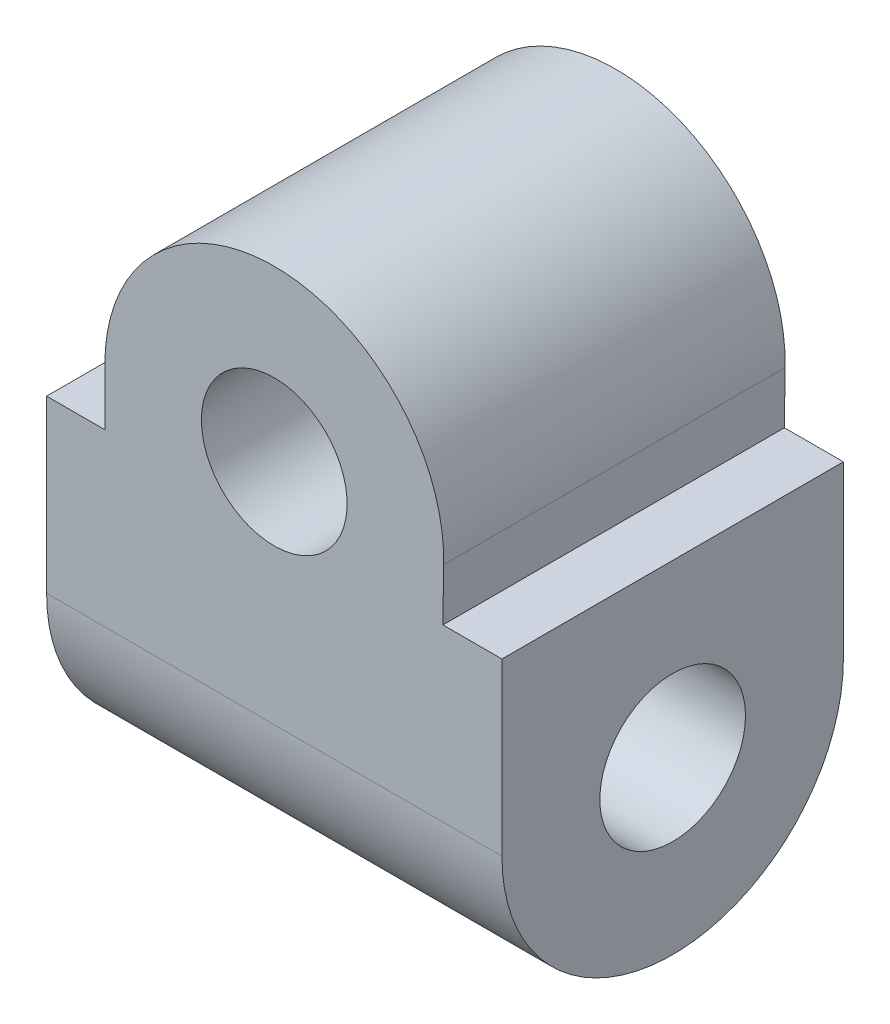
ISO-10303-21;
HEADER;
FILE_DESCRIPTION(('STEP AP214'),'2;1');
FILE_NAME('part.step','',(''),(''),'','','');
FILE_SCHEMA(('AUTOMOTIVE_DESIGN { 1 0 10303 214 1 1 1 1 }'));
ENDSEC;
DATA;
#1=APPLICATION_CONTEXT('core data for automotive mechanical design processes');
#2=APPLICATION_PROTOCOL_DEFINITION('international standard','automotive_design',2000,#1);
#3=PRODUCT_CONTEXT('',#1,'mechanical');
#4=PRODUCT('Part','Part','',(#3));
#5=PRODUCT_RELATED_PRODUCT_CATEGORY('part','',(#4));
#6=PRODUCT_DEFINITION_FORMATION('','',#4);
#7=PRODUCT_DEFINITION_CONTEXT('part definition',#1,'design');
#8=PRODUCT_DEFINITION('design','',#6,#7);
#9=PRODUCT_DEFINITION_SHAPE('','',#8);
#10=(LENGTH_UNIT() NAMED_UNIT(*) SI_UNIT(.MILLI.,.METRE.));
#11=(NAMED_UNIT(*) PLANE_ANGLE_UNIT() SI_UNIT($,.RADIAN.));
#12=(NAMED_UNIT(*) SI_UNIT($,.STERADIAN.) SOLID_ANGLE_UNIT());
#13=UNCERTAINTY_MEASURE_WITH_UNIT(LENGTH_MEASURE(1.E-05),#10,'distance_accuracy_value','');
#14=(GEOMETRIC_REPRESENTATION_CONTEXT(3) GLOBAL_UNCERTAINTY_ASSIGNED_CONTEXT((#13)) GLOBAL_UNIT_ASSIGNED_CONTEXT((#10,
#11,#12)) REPRESENTATION_CONTEXT('',''));
#15=CARTESIAN_POINT('',(0.,0.,0.));
#16=DIRECTION('',(0.,0.,1.));
#17=DIRECTION('',(1.,0.,0.));
#18=AXIS2_PLACEMENT_3D('',#15,#16,#17);
#19=CARTESIAN_POINT('',(40.,0.,0.));
#20=DIRECTION('',(1.,0.,0.));
#21=DIRECTION('',(0.,0.,-1.));
#22=AXIS2_PLACEMENT_3D('',#19,#20,#21);
#23=PLANE('',#22);
#24=DIRECTION('',(0.,0.,-1.));
#25=VECTOR('',#24,1.);
#26=CARTESIAN_POINT('',(40.,15.,0.));
#27=LINE('',#26,#25);
#28=CARTESIAN_POINT('',(40.,15.,15.));
#29=VERTEX_POINT('',#28);
#30=CARTESIAN_POINT('',(40.,15.,-15.));
#31=VERTEX_POINT('',#30);
#32=EDGE_CURVE('E158',#29,#31,#27,.T.);
#33=ORIENTED_EDGE('',*,*,#32,.F.);
#34=DIRECTION('',(0.,-1.,0.));
#35=VECTOR('',#34,1.);
#36=CARTESIAN_POINT('',(40.,0.,15.));
#37=LINE('',#36,#35);
#38=CARTESIAN_POINT('',(40.,0.,15.));
#39=VERTEX_POINT('',#38);
#40=EDGE_CURVE('E61',#29,#39,#37,.T.);
#41=ORIENTED_EDGE('',*,*,#40,.T.);
#42=CARTESIAN_POINT('',(40.,0.,0.));
#43=DIRECTION('',(1.,0.,0.));
#44=DIRECTION('',(0.,0.,-1.));
#45=AXIS2_PLACEMENT_3D('',#42,#43,#44);
#46=CIRCLE('',#45,15.);
#47=CARTESIAN_POINT('',(40.,0.,-15.));
#48=VERTEX_POINT('',#47);
#49=EDGE_CURVE('E87',#39,#48,#46,.T.);
#50=ORIENTED_EDGE('',*,*,#49,.T.);
#51=DIRECTION('',(0.,1.,0.));
#52=VECTOR('',#51,1.);
#53=CARTESIAN_POINT('',(40.,0.,-15.));
#54=LINE('',#53,#52);
#55=EDGE_CURVE('E162',#48,#31,#54,.T.);
#56=ORIENTED_EDGE('',*,*,#55,.T.);
#57=EDGE_LOOP('',(#33,#41,#50,#56));
#58=FACE_BOUND('',#57,.T.);
#59=CARTESIAN_POINT('',(40.,0.,0.));
#60=DIRECTION('',(1.,0.,0.));
#61=DIRECTION('',(0.,0.,-1.));
#62=AXIS2_PLACEMENT_3D('',#59,#60,#61);
#63=CIRCLE('',#62,6.4);
#64=CARTESIAN_POINT('',(40.,0.,-6.4));
#65=VERTEX_POINT('',#64);
#66=EDGE_CURVE('E100',#65,#65,#63,.T.);
#67=ORIENTED_EDGE('',*,*,#66,.F.);
#68=EDGE_LOOP('',(#67));
#69=FACE_BOUND('',#68,.T.);
#70=ADVANCED_FACE('F37',(#58,#69),#23,.T.);
#71=CARTESIAN_POINT('',(0.,0.,0.));
#72=DIRECTION('',(1.,0.,0.));
#73=DIRECTION('',(0.,0.,-1.));
#74=AXIS2_PLACEMENT_3D('',#71,#72,#73);
#75=PLANE('',#74);
#76=DIRECTION('',(0.,-1.,0.));
#77=VECTOR('',#76,1.);
#78=CARTESIAN_POINT('',(0.,0.,15.));
#79=LINE('',#78,#77);
#80=CARTESIAN_POINT('',(0.,15.,15.));
#81=VERTEX_POINT('',#80);
#82=CARTESIAN_POINT('',(0.,0.,15.));
#83=VERTEX_POINT('',#82);
#84=EDGE_CURVE('E75',#81,#83,#79,.T.);
#85=ORIENTED_EDGE('',*,*,#84,.F.);
#86=DIRECTION('',(0.,0.,-1.));
#87=VECTOR('',#86,1.);
#88=CARTESIAN_POINT('',(0.,15.,0.));
#89=LINE('',#88,#87);
#90=CARTESIAN_POINT('',(0.,15.,-15.));
#91=VERTEX_POINT('',#90);
#92=EDGE_CURVE('E114',#81,#91,#89,.T.);
#93=ORIENTED_EDGE('',*,*,#92,.T.);
#94=DIRECTION('',(0.,1.,0.));
#95=VECTOR('',#94,1.);
#96=CARTESIAN_POINT('',(0.,0.,-15.));
#97=LINE('',#96,#95);
#98=CARTESIAN_POINT('',(0.,0.,-15.));
#99=VERTEX_POINT('',#98);
#100=EDGE_CURVE('E88',#99,#91,#97,.T.);
#101=ORIENTED_EDGE('',*,*,#100,.F.);
#102=CARTESIAN_POINT('',(0.,0.,0.));
#103=DIRECTION('',(1.,0.,0.));
#104=DIRECTION('',(0.,0.,-1.));
#105=AXIS2_PLACEMENT_3D('',#102,#103,#104);
#106=CIRCLE('',#105,15.);
#107=EDGE_CURVE('E93',#83,#99,#106,.T.);
#108=ORIENTED_EDGE('',*,*,#107,.F.);
#109=EDGE_LOOP('',(#85,#93,#101,#108));
#110=FACE_BOUND('',#109,.T.);
#111=CARTESIAN_POINT('',(0.,0.,0.));
#112=DIRECTION('',(1.,0.,0.));
#113=DIRECTION('',(0.,0.,-1.));
#114=AXIS2_PLACEMENT_3D('',#111,#112,#113);
#115=CIRCLE('',#114,6.4);
#116=CARTESIAN_POINT('',(0.,0.,-6.4));
#117=VERTEX_POINT('',#116);
#118=EDGE_CURVE('E104',#117,#117,#115,.T.);
#119=ORIENTED_EDGE('',*,*,#118,.T.);
#120=EDGE_LOOP('',(#119));
#121=FACE_BOUND('',#120,.T.);
#122=ADVANCED_FACE('F96',(#110,#121),#75,.F.);
#123=CARTESIAN_POINT('',(40.,0.,0.));
#124=DIRECTION('',(-1.,0.,0.));
#125=DIRECTION('',(0.,0.,1.));
#126=AXIS2_PLACEMENT_3D('',#123,#124,#125);
#127=CYLINDRICAL_SURFACE('',#126,15.);
#128=ORIENTED_EDGE('',*,*,#107,.T.);
#129=DIRECTION('',(-1.,0.,0.));
#130=VECTOR('',#129,1.);
#131=CARTESIAN_POINT('',(40.,0.,-15.));
#132=LINE('',#131,#130);
#133=EDGE_CURVE('E94',#48,#99,#132,.T.);
#134=ORIENTED_EDGE('',*,*,#133,.F.);
#135=ORIENTED_EDGE('',*,*,#49,.F.);
#136=DIRECTION('',(-1.,0.,0.));
#137=VECTOR('',#136,1.);
#138=CARTESIAN_POINT('',(40.,0.,15.));
#139=LINE('',#138,#137);
#140=EDGE_CURVE('E79',#39,#83,#139,.T.);
#141=ORIENTED_EDGE('',*,*,#140,.T.);
#142=EDGE_LOOP('',(#128,#134,#135,#141));
#143=FACE_BOUND('',#142,.T.);
#144=ADVANCED_FACE('F39',(#143),#127,.T.);
#145=CARTESIAN_POINT('',(40.,0.,-15.));
#146=DIRECTION('',(0.,0.,1.));
#147=DIRECTION('',(1.,0.,0.));
#148=AXIS2_PLACEMENT_3D('',#145,#146,#147);
#149=PLANE('',#148);
#150=CARTESIAN_POINT('',(20.,20.,-15.));
#151=DIRECTION('',(0.,0.,-1.));
#152=DIRECTION('',(-1.,0.,0.));
#153=AXIS2_PLACEMENT_3D('',#150,#151,#152);
#154=CIRCLE('',#153,6.4);
#155=CARTESIAN_POINT('',(13.6,20.,-15.));
#156=VERTEX_POINT('',#155);
#157=EDGE_CURVE('E115',#156,#156,#154,.T.);
#158=ORIENTED_EDGE('',*,*,#157,.F.);
#159=EDGE_LOOP('',(#158));
#160=FACE_BOUND('',#159,.T.);
#161=DIRECTION('',(0.0130738964265423,0.999914532963807,0.));
#162=VECTOR('',#161,1.);
#163=CARTESIAN_POINT('',(34.8169645801396,15.,-15.));
#164=LINE('',#163,#162);
#165=CARTESIAN_POINT('',(34.8169645801396,15.,-15.));
#166=VERTEX_POINT('',#165);
#167=CARTESIAN_POINT('',(34.8772520692594,19.6108929243419,-15.));
#168=VERTEX_POINT('',#167);
#169=EDGE_CURVE('E154',#166,#168,#164,.T.);
#170=ORIENTED_EDGE('',*,*,#169,.F.);
#171=DIRECTION('',(-1.,0.,0.));
#172=VECTOR('',#171,1.);
#173=CARTESIAN_POINT('',(46.0074782063566,15.,-15.));
#174=LINE('',#173,#172);
#175=EDGE_CURVE('E144',#31,#166,#174,.T.);
#176=ORIENTED_EDGE('',*,*,#175,.F.);
#177=ORIENTED_EDGE('',*,*,#55,.F.);
#178=ORIENTED_EDGE('',*,*,#133,.T.);
#179=ORIENTED_EDGE('',*,*,#100,.T.);
#180=DIRECTION('',(-1.,0.,0.));
#181=VECTOR('',#180,1.);
#182=CARTESIAN_POINT('',(5.11766035031421,15.,-15.));
#183=LINE('',#182,#181);
#184=CARTESIAN_POINT('',(5.11766035031421,15.,-15.));
#185=VERTEX_POINT('',#184);
#186=EDGE_CURVE('E169',#185,#91,#183,.T.);
#187=ORIENTED_EDGE('',*,*,#186,.F.);
#188=DIRECTION('',(0.,-1.,0.));
#189=VECTOR('',#188,1.);
#190=CARTESIAN_POINT('',(5.11766035031421,20.,-15.));
#191=LINE('',#190,#189);
#192=CARTESIAN_POINT('',(5.11766035031421,20.,-15.));
#193=VERTEX_POINT('',#192);
#194=EDGE_CURVE('E172',#193,#185,#191,.T.);
#195=ORIENTED_EDGE('',*,*,#194,.F.);
#196=CARTESIAN_POINT('',(20.,20.,-15.));
#197=DIRECTION('',(0.,0.,1.));
#198=DIRECTION('',(-1.,0.,0.));
#199=AXIS2_PLACEMENT_3D('',#196,#197,#198);
#200=CIRCLE('',#199,14.8823396496858);
#201=EDGE_CURVE('E176',#168,#193,#200,.T.);
#202=ORIENTED_EDGE('',*,*,#201,.F.);
#203=EDGE_LOOP('',(#170,#176,#177,#178,#179,#187,#195,#202));
#204=FACE_BOUND('',#203,.T.);
#205=ADVANCED_FACE('F167',(#160,#204),#149,.F.);
#206=CARTESIAN_POINT('',(40.,0.,15.));
#207=DIRECTION('',(0.,0.,-1.));
#208=DIRECTION('',(-1.,0.,0.));
#209=AXIS2_PLACEMENT_3D('',#206,#207,#208);
#210=PLANE('',#209);
#211=ORIENTED_EDGE('',*,*,#40,.F.);
#212=DIRECTION('',(-1.,0.,0.));
#213=VECTOR('',#212,1.);
#214=CARTESIAN_POINT('',(40.,15.,15.));
#215=LINE('',#214,#213);
#216=CARTESIAN_POINT('',(34.8169645801396,15.,15.));
#217=VERTEX_POINT('',#216);
#218=EDGE_CURVE('E11',#29,#217,#215,.T.);
#219=ORIENTED_EDGE('',*,*,#218,.T.);
#220=DIRECTION('',(0.0130738964265423,0.999914532963807,0.));
#221=VECTOR('',#220,1.);
#222=CARTESIAN_POINT('',(34.6217588140408,0.0703205783136071,15.));
#223=LINE('',#222,#221);
#224=CARTESIAN_POINT('',(34.8772520692594,19.6108929243419,15.));
#225=VERTEX_POINT('',#224);
#226=EDGE_CURVE('E45',#217,#225,#223,.T.);
#227=ORIENTED_EDGE('',*,*,#226,.T.);
#228=CARTESIAN_POINT('',(20.,20.,15.));
#229=DIRECTION('',(0.,0.,-1.));
#230=DIRECTION('',(-1.,0.,0.));
#231=AXIS2_PLACEMENT_3D('',#228,#229,#230);
#232=CIRCLE('',#231,14.8823396496858);
#233=CARTESIAN_POINT('',(5.11766035031421,20.,15.));
#234=VERTEX_POINT('',#233);
#235=EDGE_CURVE('E118',#225,#234,#232,.F.);
#236=ORIENTED_EDGE('',*,*,#235,.T.);
#237=DIRECTION('',(0.,-1.,0.));
#238=VECTOR('',#237,1.);
#239=CARTESIAN_POINT('',(5.1176603503142,0.,15.));
#240=LINE('',#239,#238);
#241=CARTESIAN_POINT('',(5.11766035031421,15.,15.));
#242=VERTEX_POINT('',#241);
#243=EDGE_CURVE('E110',#234,#242,#240,.T.);
#244=ORIENTED_EDGE('',*,*,#243,.T.);
#245=DIRECTION('',(-1.,0.,0.));
#246=VECTOR('',#245,1.);
#247=CARTESIAN_POINT('',(40.,15.,15.));
#248=LINE('',#247,#246);
#249=EDGE_CURVE('E83',#242,#81,#248,.T.);
#250=ORIENTED_EDGE('',*,*,#249,.T.);
#251=ORIENTED_EDGE('',*,*,#84,.T.);
#252=ORIENTED_EDGE('',*,*,#140,.F.);
#253=EDGE_LOOP('',(#211,#219,#227,#236,#244,#250,#251,#252));
#254=FACE_BOUND('',#253,.T.);
#255=CARTESIAN_POINT('',(20.,20.,15.));
#256=DIRECTION('',(0.,0.,-1.));
#257=DIRECTION('',(-1.,0.,0.));
#258=AXIS2_PLACEMENT_3D('',#255,#256,#257);
#259=CIRCLE('',#258,6.4);
#260=CARTESIAN_POINT('',(13.6,20.,15.));
#261=VERTEX_POINT('',#260);
#262=EDGE_CURVE('E111',#261,#261,#259,.T.);
#263=ORIENTED_EDGE('',*,*,#262,.T.);
#264=EDGE_LOOP('',(#263));
#265=FACE_BOUND('',#264,.T.);
#266=ADVANCED_FACE('F77',(#254,#265),#210,.F.);
#267=CARTESIAN_POINT('',(40.,0.,0.));
#268=DIRECTION('',(-1.,0.,0.));
#269=DIRECTION('',(0.,0.,1.));
#270=AXIS2_PLACEMENT_3D('',#267,#268,#269);
#271=CYLINDRICAL_SURFACE('',#270,6.4);
#272=ORIENTED_EDGE('',*,*,#66,.T.);
#273=EDGE_LOOP('',(#272));
#274=FACE_BOUND('',#273,.T.);
#275=ORIENTED_EDGE('',*,*,#118,.F.);
#276=EDGE_LOOP('',(#275));
#277=FACE_BOUND('',#276,.T.);
#278=ADVANCED_FACE('F215',(#274,#277),#271,.F.);
#279=CARTESIAN_POINT('',(20.,20.,28.));
#280=DIRECTION('',(0.,0.,-1.));
#281=DIRECTION('',(-1.,0.,0.));
#282=AXIS2_PLACEMENT_3D('',#279,#280,#281);
#283=CYLINDRICAL_SURFACE('',#282,6.4);
#284=ORIENTED_EDGE('',*,*,#157,.T.);
#285=EDGE_LOOP('',(#284));
#286=FACE_BOUND('',#285,.T.);
#287=ORIENTED_EDGE('',*,*,#262,.F.);
#288=EDGE_LOOP('',(#287));
#289=FACE_BOUND('',#288,.T.);
#290=ADVANCED_FACE('F226',(#286,#289),#283,.F.);
#291=CARTESIAN_POINT('',(20.,20.,28.));
#292=DIRECTION('',(0.,0.,-1.));
#293=DIRECTION('',(-1.,0.,0.));
#294=AXIS2_PLACEMENT_3D('',#291,#292,#293);
#295=CYLINDRICAL_SURFACE('',#294,14.8823396496858);
#296=DIRECTION('',(0.,0.,-1.));
#297=VECTOR('',#296,1.);
#298=CARTESIAN_POINT('',(34.8772520692594,19.6108929243419,28.));
#299=LINE('',#298,#297);
#300=EDGE_CURVE('E137',#225,#168,#299,.T.);
#301=ORIENTED_EDGE('',*,*,#300,.T.);
#302=ORIENTED_EDGE('',*,*,#201,.T.);
#303=DIRECTION('',(0.,0.,-1.));
#304=VECTOR('',#303,1.);
#305=CARTESIAN_POINT('',(5.11766035031421,20.,28.));
#306=LINE('',#305,#304);
#307=EDGE_CURVE('E148',#234,#193,#306,.T.);
#308=ORIENTED_EDGE('',*,*,#307,.F.);
#309=ORIENTED_EDGE('',*,*,#235,.F.);
#310=EDGE_LOOP('',(#301,#302,#308,#309));
#311=FACE_BOUND('',#310,.T.);
#312=ADVANCED_FACE('F182',(#311),#295,.T.);
#313=CARTESIAN_POINT('',(34.8169645801396,15.,28.));
#314=DIRECTION('',(-0.999914532963807,0.0130738964265423,0.));
#315=DIRECTION('',(-0.0130738964265423,-0.999914532963807,0.));
#316=AXIS2_PLACEMENT_3D('',#313,#314,#315);
#317=PLANE('',#316);
#318=DIRECTION('',(0.,0.,-1.));
#319=VECTOR('',#318,1.);
#320=CARTESIAN_POINT('',(34.8169645801396,15.,28.));
#321=LINE('',#320,#319);
#322=EDGE_CURVE('E134',#217,#166,#321,.T.);
#323=ORIENTED_EDGE('',*,*,#322,.T.);
#324=ORIENTED_EDGE('',*,*,#169,.T.);
#325=ORIENTED_EDGE('',*,*,#300,.F.);
#326=ORIENTED_EDGE('',*,*,#226,.F.);
#327=EDGE_LOOP('',(#323,#324,#325,#326));
#328=FACE_BOUND('',#327,.T.);
#329=ADVANCED_FACE('F131',(#328),#317,.F.);
#330=CARTESIAN_POINT('',(5.11766035031421,15.,28.));
#331=DIRECTION('',(0.,-1.,0.));
#332=DIRECTION('',(1.,0.,0.));
#333=AXIS2_PLACEMENT_3D('',#330,#331,#332);
#334=PLANE('',#333);
#335=ORIENTED_EDGE('',*,*,#249,.F.);
#336=DIRECTION('',(0.,0.,-1.));
#337=VECTOR('',#336,1.);
#338=CARTESIAN_POINT('',(5.11766035031421,15.,28.));
#339=LINE('',#338,#337);
#340=EDGE_CURVE('E52',#242,#185,#339,.T.);
#341=ORIENTED_EDGE('',*,*,#340,.T.);
#342=ORIENTED_EDGE('',*,*,#186,.T.);
#343=ORIENTED_EDGE('',*,*,#92,.F.);
#344=EDGE_LOOP('',(#335,#341,#342,#343));
#345=FACE_BOUND('',#344,.T.);
#346=ADVANCED_FACE('F198',(#345),#334,.F.);
#347=CARTESIAN_POINT('',(5.11766035031421,20.,28.));
#348=DIRECTION('',(1.,0.,0.));
#349=DIRECTION('',(0.,1.,0.));
#350=AXIS2_PLACEMENT_3D('',#347,#348,#349);
#351=PLANE('',#350);
#352=ORIENTED_EDGE('',*,*,#307,.T.);
#353=ORIENTED_EDGE('',*,*,#194,.T.);
#354=ORIENTED_EDGE('',*,*,#340,.F.);
#355=ORIENTED_EDGE('',*,*,#243,.F.);
#356=EDGE_LOOP('',(#352,#353,#354,#355));
#357=FACE_BOUND('',#356,.T.);
#358=ADVANCED_FACE('F187',(#357),#351,.F.);
#359=CARTESIAN_POINT('',(46.0074782063566,15.,28.));
#360=DIRECTION('',(0.,-1.,0.));
#361=DIRECTION('',(0.,0.,-1.));
#362=AXIS2_PLACEMENT_3D('',#359,#360,#361);
#363=PLANE('',#362);
#364=ORIENTED_EDGE('',*,*,#32,.T.);
#365=ORIENTED_EDGE('',*,*,#175,.T.);
#366=ORIENTED_EDGE('',*,*,#322,.F.);
#367=ORIENTED_EDGE('',*,*,#218,.F.);
#368=EDGE_LOOP('',(#364,#365,#366,#367));
#369=FACE_BOUND('',#368,.T.);
#370=ADVANCED_FACE('F142',(#369),#363,.F.);
#371=CLOSED_SHELL('',(#70,#122,#144,#205,#266,#278,#290,#312,#329,#346,#358,#370));
#372=MANIFOLD_SOLID_BREP('B2',#371);
#373=ADVANCED_BREP_SHAPE_REPRESENTATION('',(#18,#372),#14);
#374=SHAPE_DEFINITION_REPRESENTATION(#9,#373);
ENDSEC;
END-ISO-10303-21;
